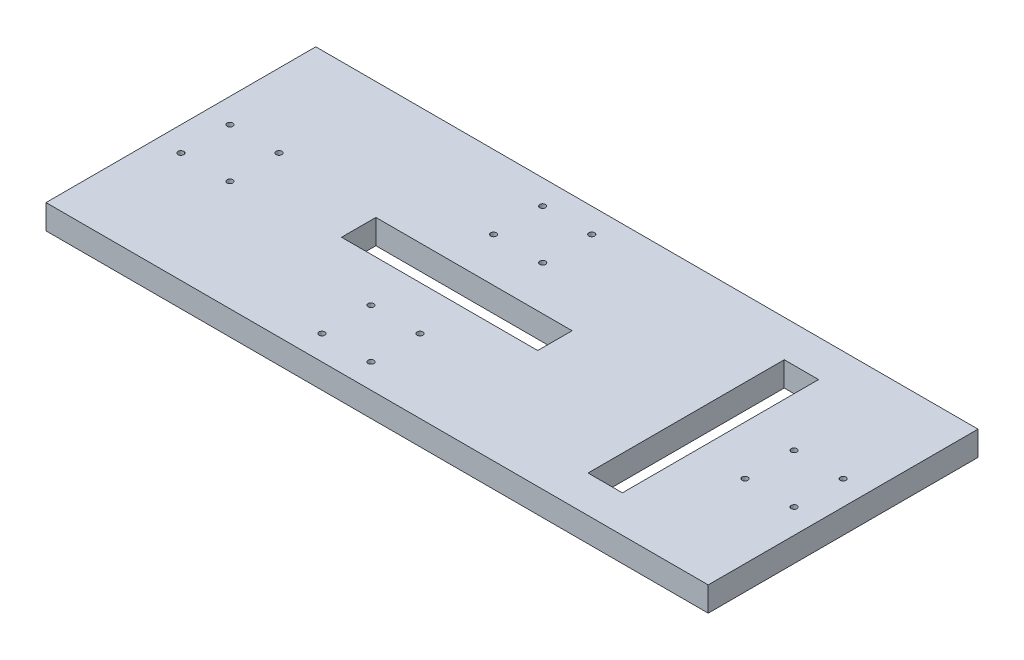
ISO-10303-21;
HEADER;
FILE_DESCRIPTION(('STEP AP214'),'2;1');
FILE_NAME('part.step','',(''),(''),'','','');
FILE_SCHEMA(('AUTOMOTIVE_DESIGN { 1 0 10303 214 1 1 1 1 }'));
ENDSEC;
DATA;
#1=APPLICATION_CONTEXT('core data for automotive mechanical design processes');
#2=APPLICATION_PROTOCOL_DEFINITION('international standard','automotive_design',2000,#1);
#3=PRODUCT_CONTEXT('',#1,'mechanical');
#4=PRODUCT('Part','Part','',(#3));
#5=PRODUCT_RELATED_PRODUCT_CATEGORY('part','',(#4));
#6=PRODUCT_DEFINITION_FORMATION('','',#4);
#7=PRODUCT_DEFINITION_CONTEXT('part definition',#1,'design');
#8=PRODUCT_DEFINITION('design','',#6,#7);
#9=PRODUCT_DEFINITION_SHAPE('','',#8);
#10=(LENGTH_UNIT() NAMED_UNIT(*) SI_UNIT(.MILLI.,.METRE.));
#11=(NAMED_UNIT(*) PLANE_ANGLE_UNIT() SI_UNIT($,.RADIAN.));
#12=(NAMED_UNIT(*) SI_UNIT($,.STERADIAN.) SOLID_ANGLE_UNIT());
#13=UNCERTAINTY_MEASURE_WITH_UNIT(LENGTH_MEASURE(1.E-05),#10,'distance_accuracy_value','');
#14=(GEOMETRIC_REPRESENTATION_CONTEXT(3) GLOBAL_UNCERTAINTY_ASSIGNED_CONTEXT((#13)) GLOBAL_UNIT_ASSIGNED_CONTEXT((#10,
#11,#12)) REPRESENTATION_CONTEXT('',''));
#15=CARTESIAN_POINT('',(0.,0.,0.));
#16=DIRECTION('',(0.,0.,1.));
#17=DIRECTION('',(1.,0.,0.));
#18=AXIS2_PLACEMENT_3D('',#15,#16,#17);
#19=CARTESIAN_POINT('',(0.,12.7,0.));
#20=DIRECTION('',(1.,0.,0.));
#21=DIRECTION('',(0.,0.,-1.));
#22=AXIS2_PLACEMENT_3D('',#19,#20,#21);
#23=PLANE('',#22);
#24=DIRECTION('',(0.,0.,1.));
#25=VECTOR('',#24,1.);
#26=CARTESIAN_POINT('',(0.,0.,0.));
#27=LINE('',#26,#25);
#28=CARTESIAN_POINT('',(0.,0.,-139.7));
#29=VERTEX_POINT('',#28);
#30=CARTESIAN_POINT('',(0.,0.,0.));
#31=VERTEX_POINT('',#30);
#32=EDGE_CURVE('E243',#29,#31,#27,.T.);
#33=ORIENTED_EDGE('',*,*,#32,.T.);
#34=DIRECTION('',(0.,-1.,0.));
#35=VECTOR('',#34,1.);
#36=CARTESIAN_POINT('',(0.,12.7,0.));
#37=LINE('',#36,#35);
#38=CARTESIAN_POINT('',(0.,12.7,0.));
#39=VERTEX_POINT('',#38);
#40=EDGE_CURVE('E11',#39,#31,#37,.T.);
#41=ORIENTED_EDGE('',*,*,#40,.F.);
#42=DIRECTION('',(0.,0.,1.));
#43=VECTOR('',#42,1.);
#44=CARTESIAN_POINT('',(0.,12.7,0.));
#45=LINE('',#44,#43);
#46=CARTESIAN_POINT('',(0.,12.7,-139.7));
#47=VERTEX_POINT('',#46);
#48=EDGE_CURVE('E246',#47,#39,#45,.T.);
#49=ORIENTED_EDGE('',*,*,#48,.F.);
#50=DIRECTION('',(0.,-1.,0.));
#51=VECTOR('',#50,1.);
#52=CARTESIAN_POINT('',(0.,12.7,-139.7));
#53=LINE('',#52,#51);
#54=EDGE_CURVE('E256',#47,#29,#53,.T.);
#55=ORIENTED_EDGE('',*,*,#54,.T.);
#56=EDGE_LOOP('',(#33,#41,#49,#55));
#57=FACE_BOUND('',#56,.T.);
#58=ADVANCED_FACE('F36',(#57),#23,.F.);
#59=CARTESIAN_POINT('',(0.,12.7,0.));
#60=DIRECTION('',(0.,0.,-1.));
#61=DIRECTION('',(-1.,0.,0.));
#62=AXIS2_PLACEMENT_3D('',#59,#60,#61);
#63=PLANE('',#62);
#64=DIRECTION('',(1.,0.,0.));
#65=VECTOR('',#64,1.);
#66=CARTESIAN_POINT('',(0.,0.,0.));
#67=LINE('',#66,#65);
#68=CARTESIAN_POINT('',(342.9,0.,0.));
#69=VERTEX_POINT('',#68);
#70=EDGE_CURVE('E259',#31,#69,#67,.T.);
#71=ORIENTED_EDGE('',*,*,#70,.T.);
#72=DIRECTION('',(0.,-1.,0.));
#73=VECTOR('',#72,1.);
#74=CARTESIAN_POINT('',(342.9,12.7,0.));
#75=LINE('',#74,#73);
#76=CARTESIAN_POINT('',(342.9,12.7,0.));
#77=VERTEX_POINT('',#76);
#78=EDGE_CURVE('E43',#77,#69,#75,.T.);
#79=ORIENTED_EDGE('',*,*,#78,.F.);
#80=DIRECTION('',(1.,0.,0.));
#81=VECTOR('',#80,1.);
#82=CARTESIAN_POINT('',(0.,12.7,0.));
#83=LINE('',#82,#81);
#84=EDGE_CURVE('E249',#39,#77,#83,.T.);
#85=ORIENTED_EDGE('',*,*,#84,.F.);
#86=ORIENTED_EDGE('',*,*,#40,.T.);
#87=EDGE_LOOP('',(#71,#79,#85,#86));
#88=FACE_BOUND('',#87,.T.);
#89=ADVANCED_FACE('F288',(#88),#63,.F.);
#90=CARTESIAN_POINT('',(342.9,12.7,0.));
#91=DIRECTION('',(-1.,0.,0.));
#92=DIRECTION('',(0.,0.,1.));
#93=AXIS2_PLACEMENT_3D('',#90,#91,#92);
#94=PLANE('',#93);
#95=DIRECTION('',(0.,0.,-1.));
#96=VECTOR('',#95,1.);
#97=CARTESIAN_POINT('',(342.9,0.,0.));
#98=LINE('',#97,#96);
#99=CARTESIAN_POINT('',(342.9,0.,-139.7));
#100=VERTEX_POINT('',#99);
#101=EDGE_CURVE('E261',#69,#100,#98,.T.);
#102=ORIENTED_EDGE('',*,*,#101,.T.);
#103=DIRECTION('',(0.,-1.,0.));
#104=VECTOR('',#103,1.);
#105=CARTESIAN_POINT('',(342.9,12.7,-139.7));
#106=LINE('',#105,#104);
#107=CARTESIAN_POINT('',(342.9,12.7,-139.7));
#108=VERTEX_POINT('',#107);
#109=EDGE_CURVE('E266',#108,#100,#106,.T.);
#110=ORIENTED_EDGE('',*,*,#109,.F.);
#111=DIRECTION('',(0.,0.,-1.));
#112=VECTOR('',#111,1.);
#113=CARTESIAN_POINT('',(342.9,12.7,0.));
#114=LINE('',#113,#112);
#115=EDGE_CURVE('E252',#77,#108,#114,.T.);
#116=ORIENTED_EDGE('',*,*,#115,.F.);
#117=ORIENTED_EDGE('',*,*,#78,.T.);
#118=EDGE_LOOP('',(#102,#110,#116,#117));
#119=FACE_BOUND('',#118,.T.);
#120=ADVANCED_FACE('F273',(#119),#94,.F.);
#121=CARTESIAN_POINT('',(0.,12.7,-139.7));
#122=DIRECTION('',(0.,0.,1.));
#123=DIRECTION('',(1.,0.,0.));
#124=AXIS2_PLACEMENT_3D('',#121,#122,#123);
#125=PLANE('',#124);
#126=DIRECTION('',(-1.,0.,0.));
#127=VECTOR('',#126,1.);
#128=CARTESIAN_POINT('',(0.,0.,-139.7));
#129=LINE('',#128,#127);
#130=EDGE_CURVE('E250',#100,#29,#129,.T.);
#131=ORIENTED_EDGE('',*,*,#130,.T.);
#132=ORIENTED_EDGE('',*,*,#54,.F.);
#133=DIRECTION('',(-1.,0.,0.));
#134=VECTOR('',#133,1.);
#135=CARTESIAN_POINT('',(0.,12.7,-139.7));
#136=LINE('',#135,#134);
#137=EDGE_CURVE('E254',#108,#47,#136,.T.);
#138=ORIENTED_EDGE('',*,*,#137,.F.);
#139=ORIENTED_EDGE('',*,*,#109,.T.);
#140=EDGE_LOOP('',(#131,#132,#138,#139));
#141=FACE_BOUND('',#140,.T.);
#142=ADVANCED_FACE('F281',(#141),#125,.F.);
#143=CARTESIAN_POINT('',(0.,12.7,0.));
#144=DIRECTION('',(0.,-1.,0.));
#145=DIRECTION('',(0.,0.,-1.));
#146=AXIS2_PLACEMENT_3D('',#143,#144,#145);
#147=PLANE('',#146);
#148=CARTESIAN_POINT('',(130.175,12.7,-38.1));
#149=DIRECTION('',(0.,-1.,0.));
#150=DIRECTION('',(0.,0.,-1.));
#151=AXIS2_PLACEMENT_3D('',#148,#149,#150);
#152=CIRCLE('',#151,1.5);
#153=CARTESIAN_POINT('',(130.175,12.7,-39.6));
#154=VERTEX_POINT('',#153);
#155=EDGE_CURVE('E417',#154,#154,#152,.T.);
#156=ORIENTED_EDGE('',*,*,#155,.T.);
#157=EDGE_LOOP('',(#156));
#158=FACE_BOUND('',#157,.T.);
#159=CARTESIAN_POINT('',(155.575,12.7,-38.1));
#160=DIRECTION('',(0.,-1.,0.));
#161=DIRECTION('',(0.,0.,-1.));
#162=AXIS2_PLACEMENT_3D('',#159,#160,#161);
#163=CIRCLE('',#162,1.5);
#164=CARTESIAN_POINT('',(155.575,12.7,-39.6));
#165=VERTEX_POINT('',#164);
#166=EDGE_CURVE('E409',#165,#165,#163,.T.);
#167=ORIENTED_EDGE('',*,*,#166,.T.);
#168=EDGE_LOOP('',(#167));
#169=FACE_BOUND('',#168,.T.);
#170=CARTESIAN_POINT('',(155.575,12.7,-12.7));
#171=DIRECTION('',(0.,-1.,0.));
#172=DIRECTION('',(0.,0.,-1.));
#173=AXIS2_PLACEMENT_3D('',#170,#171,#172);
#174=CIRCLE('',#173,1.5);
#175=CARTESIAN_POINT('',(155.575,12.7,-14.2));
#176=VERTEX_POINT('',#175);
#177=EDGE_CURVE('E402',#176,#176,#174,.T.);
#178=ORIENTED_EDGE('',*,*,#177,.T.);
#179=EDGE_LOOP('',(#178));
#180=FACE_BOUND('',#179,.T.);
#181=CARTESIAN_POINT('',(130.175,12.7,-12.7));
#182=DIRECTION('',(0.,-1.,0.));
#183=DIRECTION('',(0.,0.,-1.));
#184=AXIS2_PLACEMENT_3D('',#181,#182,#183);
#185=CIRCLE('',#184,1.5);
#186=CARTESIAN_POINT('',(130.175,12.7,-14.2));
#187=VERTEX_POINT('',#186);
#188=EDGE_CURVE('E406',#187,#187,#185,.T.);
#189=ORIENTED_EDGE('',*,*,#188,.T.);
#190=EDGE_LOOP('',(#189));
#191=FACE_BOUND('',#190,.T.);
#192=CARTESIAN_POINT('',(130.175,12.7,-101.6));
#193=DIRECTION('',(0.,1.,0.));
#194=DIRECTION('',(0.,0.,1.));
#195=AXIS2_PLACEMENT_3D('',#192,#193,#194);
#196=CIRCLE('',#195,1.5);
#197=CARTESIAN_POINT('',(130.175,12.7,-100.1));
#198=VERTEX_POINT('',#197);
#199=EDGE_CURVE('E423',#198,#198,#196,.T.);
#200=ORIENTED_EDGE('',*,*,#199,.F.);
#201=EDGE_LOOP('',(#200));
#202=FACE_BOUND('',#201,.T.);
#203=CARTESIAN_POINT('',(155.575,12.7,-101.6));
#204=DIRECTION('',(0.,1.,0.));
#205=DIRECTION('',(0.,0.,1.));
#206=AXIS2_PLACEMENT_3D('',#203,#204,#205);
#207=CIRCLE('',#206,1.5);
#208=CARTESIAN_POINT('',(155.575,12.7,-100.1));
#209=VERTEX_POINT('',#208);
#210=EDGE_CURVE('E435',#209,#209,#207,.T.);
#211=ORIENTED_EDGE('',*,*,#210,.F.);
#212=EDGE_LOOP('',(#211));
#213=FACE_BOUND('',#212,.T.);
#214=CARTESIAN_POINT('',(155.575,12.7,-127.));
#215=DIRECTION('',(0.,1.,0.));
#216=DIRECTION('',(0.,0.,1.));
#217=AXIS2_PLACEMENT_3D('',#214,#215,#216);
#218=CIRCLE('',#217,1.5);
#219=CARTESIAN_POINT('',(155.575,12.7,-125.5));
#220=VERTEX_POINT('',#219);
#221=EDGE_CURVE('E429',#220,#220,#218,.T.);
#222=ORIENTED_EDGE('',*,*,#221,.F.);
#223=EDGE_LOOP('',(#222));
#224=FACE_BOUND('',#223,.T.);
#225=CARTESIAN_POINT('',(130.175,12.7,-127.));
#226=DIRECTION('',(0.,1.,0.));
#227=DIRECTION('',(0.,0.,1.));
#228=AXIS2_PLACEMENT_3D('',#225,#226,#227);
#229=CIRCLE('',#228,1.5);
#230=CARTESIAN_POINT('',(130.175,12.7,-125.5));
#231=VERTEX_POINT('',#230);
#232=EDGE_CURVE('E151',#231,#231,#229,.T.);
#233=ORIENTED_EDGE('',*,*,#232,.F.);
#234=EDGE_LOOP('',(#233));
#235=FACE_BOUND('',#234,.T.);
#236=DIRECTION('',(1.,0.,0.));
#237=VECTOR('',#236,1.);
#238=CARTESIAN_POINT('',(261.62,12.7,-19.05));
#239=LINE('',#238,#237);
#240=CARTESIAN_POINT('',(261.62,12.7,-19.05));
#241=VERTEX_POINT('',#240);
#242=CARTESIAN_POINT('',(279.4,12.7,-19.05));
#243=VERTEX_POINT('',#242);
#244=EDGE_CURVE('E157',#241,#243,#239,.T.);
#245=ORIENTED_EDGE('',*,*,#244,.F.);
#246=DIRECTION('',(0.,0.,1.));
#247=VECTOR('',#246,1.);
#248=CARTESIAN_POINT('',(261.62,12.7,-120.65));
#249=LINE('',#248,#247);
#250=CARTESIAN_POINT('',(261.62,12.7,-120.65));
#251=VERTEX_POINT('',#250);
#252=EDGE_CURVE('E50',#251,#241,#249,.T.);
#253=ORIENTED_EDGE('',*,*,#252,.F.);
#254=DIRECTION('',(-1.,0.,0.));
#255=VECTOR('',#254,1.);
#256=CARTESIAN_POINT('',(261.62,12.7,-120.65));
#257=LINE('',#256,#255);
#258=CARTESIAN_POINT('',(279.4,12.7,-120.65));
#259=VERTEX_POINT('',#258);
#260=EDGE_CURVE('E145',#259,#251,#257,.T.);
#261=ORIENTED_EDGE('',*,*,#260,.F.);
#262=DIRECTION('',(0.,0.,-1.));
#263=VECTOR('',#262,1.);
#264=CARTESIAN_POINT('',(279.4,12.7,-120.65));
#265=LINE('',#264,#263);
#266=EDGE_CURVE('E148',#243,#259,#265,.T.);
#267=ORIENTED_EDGE('',*,*,#266,.F.);
#268=EDGE_LOOP('',(#245,#253,#261,#267));
#269=FACE_BOUND('',#268,.T.);
#270=DIRECTION('',(1.,0.,0.));
#271=VECTOR('',#270,1.);
#272=CARTESIAN_POINT('',(92.075,12.7,-60.96));
#273=LINE('',#272,#271);
#274=CARTESIAN_POINT('',(92.075,12.7,-60.96));
#275=VERTEX_POINT('',#274);
#276=CARTESIAN_POINT('',(193.675,12.7,-60.96));
#277=VERTEX_POINT('',#276);
#278=EDGE_CURVE('E183',#275,#277,#273,.T.);
#279=ORIENTED_EDGE('',*,*,#278,.F.);
#280=DIRECTION('',(0.,0.,1.));
#281=VECTOR('',#280,1.);
#282=CARTESIAN_POINT('',(92.075,12.7,-78.74));
#283=LINE('',#282,#281);
#284=CARTESIAN_POINT('',(92.075,12.7,-78.74));
#285=VERTEX_POINT('',#284);
#286=EDGE_CURVE('E58',#285,#275,#283,.T.);
#287=ORIENTED_EDGE('',*,*,#286,.F.);
#288=DIRECTION('',(-1.,0.,0.));
#289=VECTOR('',#288,1.);
#290=CARTESIAN_POINT('',(92.075,12.7,-78.74));
#291=LINE('',#290,#289);
#292=CARTESIAN_POINT('',(193.675,12.7,-78.74));
#293=VERTEX_POINT('',#292);
#294=EDGE_CURVE('E172',#293,#285,#291,.T.);
#295=ORIENTED_EDGE('',*,*,#294,.F.);
#296=DIRECTION('',(0.,0.,-1.));
#297=VECTOR('',#296,1.);
#298=CARTESIAN_POINT('',(193.675,12.7,-78.74));
#299=LINE('',#298,#297);
#300=EDGE_CURVE('E187',#277,#293,#299,.T.);
#301=ORIENTED_EDGE('',*,*,#300,.F.);
#302=EDGE_LOOP('',(#279,#287,#295,#301));
#303=FACE_BOUND('',#302,.T.);
#304=CARTESIAN_POINT('',(38.1,12.7,-82.55));
#305=DIRECTION('',(0.,-1.,0.));
#306=DIRECTION('',(0.,0.,1.));
#307=AXIS2_PLACEMENT_3D('',#304,#305,#306);
#308=CIRCLE('',#307,1.50000004800013);
#309=CARTESIAN_POINT('',(38.1,12.7,-81.0499999519999));
#310=VERTEX_POINT('',#309);
#311=EDGE_CURVE('E164',#310,#310,#308,.T.);
#312=ORIENTED_EDGE('',*,*,#311,.T.);
#313=EDGE_LOOP('',(#312));
#314=FACE_BOUND('',#313,.T.);
#315=CARTESIAN_POINT('',(38.1,12.7,-57.15));
#316=DIRECTION('',(0.,-1.,0.));
#317=DIRECTION('',(0.,0.,1.));
#318=AXIS2_PLACEMENT_3D('',#315,#316,#317);
#319=CIRCLE('',#318,1.50000000000002);
#320=CARTESIAN_POINT('',(38.1,12.7,-55.65));
#321=VERTEX_POINT('',#320);
#322=EDGE_CURVE('E208',#321,#321,#319,.T.);
#323=ORIENTED_EDGE('',*,*,#322,.T.);
#324=EDGE_LOOP('',(#323));
#325=FACE_BOUND('',#324,.T.);
#326=CARTESIAN_POINT('',(12.7,12.7,-57.15));
#327=DIRECTION('',(0.,-1.,0.));
#328=DIRECTION('',(0.,0.,1.));
#329=AXIS2_PLACEMENT_3D('',#326,#327,#328);
#330=CIRCLE('',#329,1.50000004800013);
#331=CARTESIAN_POINT('',(12.7,12.7,-55.6499999519999));
#332=VERTEX_POINT('',#331);
#333=EDGE_CURVE('E202',#332,#332,#330,.T.);
#334=ORIENTED_EDGE('',*,*,#333,.T.);
#335=EDGE_LOOP('',(#334));
#336=FACE_BOUND('',#335,.T.);
#337=CARTESIAN_POINT('',(12.7,12.7,-82.55));
#338=DIRECTION('',(0.,-1.,0.));
#339=DIRECTION('',(0.,0.,1.));
#340=AXIS2_PLACEMENT_3D('',#337,#338,#339);
#341=CIRCLE('',#340,1.50000000000002);
#342=CARTESIAN_POINT('',(12.7,12.7,-81.05));
#343=VERTEX_POINT('',#342);
#344=EDGE_CURVE('E201',#343,#343,#341,.T.);
#345=ORIENTED_EDGE('',*,*,#344,.T.);
#346=EDGE_LOOP('',(#345));
#347=FACE_BOUND('',#346,.T.);
#348=CARTESIAN_POINT('',(304.8,12.7,-82.55));
#349=DIRECTION('',(0.,1.,0.));
#350=DIRECTION('',(0.,0.,1.));
#351=AXIS2_PLACEMENT_3D('',#348,#349,#350);
#352=CIRCLE('',#351,1.50000004800013);
#353=CARTESIAN_POINT('',(304.8,12.7,-81.0499999519999));
#354=VERTEX_POINT('',#353);
#355=EDGE_CURVE('E219',#354,#354,#352,.T.);
#356=ORIENTED_EDGE('',*,*,#355,.F.);
#357=EDGE_LOOP('',(#356));
#358=FACE_BOUND('',#357,.T.);
#359=CARTESIAN_POINT('',(304.8,12.7,-57.15));
#360=DIRECTION('',(0.,1.,0.));
#361=DIRECTION('',(0.,0.,1.));
#362=AXIS2_PLACEMENT_3D('',#359,#360,#361);
#363=CIRCLE('',#362,1.50000000000002);
#364=CARTESIAN_POINT('',(304.8,12.7,-55.65));
#365=VERTEX_POINT('',#364);
#366=EDGE_CURVE('E232',#365,#365,#363,.T.);
#367=ORIENTED_EDGE('',*,*,#366,.F.);
#368=EDGE_LOOP('',(#367));
#369=FACE_BOUND('',#368,.T.);
#370=CARTESIAN_POINT('',(330.2,12.7,-57.15));
#371=DIRECTION('',(0.,1.,0.));
#372=DIRECTION('',(0.,0.,1.));
#373=AXIS2_PLACEMENT_3D('',#370,#371,#372);
#374=CIRCLE('',#373,1.50000004800013);
#375=CARTESIAN_POINT('',(330.2,12.7,-55.6499999519999));
#376=VERTEX_POINT('',#375);
#377=EDGE_CURVE('E226',#376,#376,#374,.T.);
#378=ORIENTED_EDGE('',*,*,#377,.F.);
#379=EDGE_LOOP('',(#378));
#380=FACE_BOUND('',#379,.T.);
#381=CARTESIAN_POINT('',(330.2,12.7,-82.55));
#382=DIRECTION('',(0.,1.,0.));
#383=DIRECTION('',(0.,0.,1.));
#384=AXIS2_PLACEMENT_3D('',#381,#382,#383);
#385=CIRCLE('',#384,1.50000000000002);
#386=CARTESIAN_POINT('',(330.2,12.7,-81.05));
#387=VERTEX_POINT('',#386);
#388=EDGE_CURVE('E225',#387,#387,#385,.T.);
#389=ORIENTED_EDGE('',*,*,#388,.F.);
#390=EDGE_LOOP('',(#389));
#391=FACE_BOUND('',#390,.T.);
#392=ORIENTED_EDGE('',*,*,#48,.T.);
#393=ORIENTED_EDGE('',*,*,#84,.T.);
#394=ORIENTED_EDGE('',*,*,#115,.T.);
#395=ORIENTED_EDGE('',*,*,#137,.T.);
#396=EDGE_LOOP('',(#392,#393,#394,#395));
#397=FACE_BOUND('',#396,.T.);
#398=ADVANCED_FACE('F287',(#158,#169,#180,#191,#202,#213,#224,#235,#269,#303,#314,#325,#336,
#347,#358,#369,#380,#391,#397),#147,.F.);
#399=CARTESIAN_POINT('',(0.,0.,0.));
#400=DIRECTION('',(0.,-1.,0.));
#401=DIRECTION('',(0.,0.,-1.));
#402=AXIS2_PLACEMENT_3D('',#399,#400,#401);
#403=PLANE('',#402);
#404=CARTESIAN_POINT('',(130.175,0.,-38.1));
#405=DIRECTION('',(0.,-1.,0.));
#406=DIRECTION('',(0.,0.,-1.));
#407=AXIS2_PLACEMENT_3D('',#404,#405,#406);
#408=CIRCLE('',#407,1.5);
#409=CARTESIAN_POINT('',(130.175,0.,-39.6));
#410=VERTEX_POINT('',#409);
#411=EDGE_CURVE('E414',#410,#410,#408,.T.);
#412=ORIENTED_EDGE('',*,*,#411,.F.);
#413=EDGE_LOOP('',(#412));
#414=FACE_BOUND('',#413,.T.);
#415=CARTESIAN_POINT('',(155.575,0.,-38.1));
#416=DIRECTION('',(0.,-1.,0.));
#417=DIRECTION('',(0.,0.,-1.));
#418=AXIS2_PLACEMENT_3D('',#415,#416,#417);
#419=CIRCLE('',#418,1.5);
#420=CARTESIAN_POINT('',(155.575,0.,-39.6));
#421=VERTEX_POINT('',#420);
#422=EDGE_CURVE('E404',#421,#421,#419,.T.);
#423=ORIENTED_EDGE('',*,*,#422,.F.);
#424=EDGE_LOOP('',(#423));
#425=FACE_BOUND('',#424,.T.);
#426=CARTESIAN_POINT('',(155.575,0.,-12.7));
#427=DIRECTION('',(0.,-1.,0.));
#428=DIRECTION('',(0.,0.,-1.));
#429=AXIS2_PLACEMENT_3D('',#426,#427,#428);
#430=CIRCLE('',#429,1.5);
#431=CARTESIAN_POINT('',(155.575,0.,-14.2));
#432=VERTEX_POINT('',#431);
#433=EDGE_CURVE('E399',#432,#432,#430,.T.);
#434=ORIENTED_EDGE('',*,*,#433,.F.);
#435=EDGE_LOOP('',(#434));
#436=FACE_BOUND('',#435,.T.);
#437=CARTESIAN_POINT('',(130.175,0.,-12.7));
#438=DIRECTION('',(0.,-1.,0.));
#439=DIRECTION('',(0.,0.,-1.));
#440=AXIS2_PLACEMENT_3D('',#437,#438,#439);
#441=CIRCLE('',#440,1.5);
#442=CARTESIAN_POINT('',(130.175,0.,-14.2));
#443=VERTEX_POINT('',#442);
#444=EDGE_CURVE('E420',#443,#443,#441,.T.);
#445=ORIENTED_EDGE('',*,*,#444,.F.);
#446=EDGE_LOOP('',(#445));
#447=FACE_BOUND('',#446,.T.);
#448=CARTESIAN_POINT('',(130.175,0.,-101.6));
#449=DIRECTION('',(0.,1.,0.));
#450=DIRECTION('',(0.,0.,1.));
#451=AXIS2_PLACEMENT_3D('',#448,#449,#450);
#452=CIRCLE('',#451,1.5);
#453=CARTESIAN_POINT('',(130.175,0.,-100.1));
#454=VERTEX_POINT('',#453);
#455=EDGE_CURVE('E438',#454,#454,#452,.T.);
#456=ORIENTED_EDGE('',*,*,#455,.T.);
#457=EDGE_LOOP('',(#456));
#458=FACE_BOUND('',#457,.T.);
#459=CARTESIAN_POINT('',(155.575,0.,-101.6));
#460=DIRECTION('',(0.,1.,0.));
#461=DIRECTION('',(0.,0.,1.));
#462=AXIS2_PLACEMENT_3D('',#459,#460,#461);
#463=CIRCLE('',#462,1.5);
#464=CARTESIAN_POINT('',(155.575,0.,-100.1));
#465=VERTEX_POINT('',#464);
#466=EDGE_CURVE('E432',#465,#465,#463,.T.);
#467=ORIENTED_EDGE('',*,*,#466,.T.);
#468=EDGE_LOOP('',(#467));
#469=FACE_BOUND('',#468,.T.);
#470=CARTESIAN_POINT('',(155.575,0.,-127.));
#471=DIRECTION('',(0.,1.,0.));
#472=DIRECTION('',(0.,0.,1.));
#473=AXIS2_PLACEMENT_3D('',#470,#471,#472);
#474=CIRCLE('',#473,1.5);
#475=CARTESIAN_POINT('',(155.575,0.,-125.5));
#476=VERTEX_POINT('',#475);
#477=EDGE_CURVE('E426',#476,#476,#474,.T.);
#478=ORIENTED_EDGE('',*,*,#477,.T.);
#479=EDGE_LOOP('',(#478));
#480=FACE_BOUND('',#479,.T.);
#481=CARTESIAN_POINT('',(130.175,0.,-127.));
#482=DIRECTION('',(0.,1.,0.));
#483=DIRECTION('',(0.,0.,1.));
#484=AXIS2_PLACEMENT_3D('',#481,#482,#483);
#485=CIRCLE('',#484,1.5);
#486=CARTESIAN_POINT('',(130.175,0.,-125.5));
#487=VERTEX_POINT('',#486);
#488=EDGE_CURVE('E184',#487,#487,#485,.T.);
#489=ORIENTED_EDGE('',*,*,#488,.T.);
#490=EDGE_LOOP('',(#489));
#491=FACE_BOUND('',#490,.T.);
#492=DIRECTION('',(0.,0.,1.));
#493=VECTOR('',#492,1.);
#494=CARTESIAN_POINT('',(261.62,0.,-120.65));
#495=LINE('',#494,#493);
#496=CARTESIAN_POINT('',(261.62,0.,-120.65));
#497=VERTEX_POINT('',#496);
#498=CARTESIAN_POINT('',(261.62,0.,-19.05));
#499=VERTEX_POINT('',#498);
#500=EDGE_CURVE('E126',#497,#499,#495,.T.);
#501=ORIENTED_EDGE('',*,*,#500,.T.);
#502=DIRECTION('',(1.,0.,0.));
#503=VECTOR('',#502,1.);
#504=CARTESIAN_POINT('',(261.62,0.,-19.05));
#505=LINE('',#504,#503);
#506=CARTESIAN_POINT('',(279.4,0.,-19.05));
#507=VERTEX_POINT('',#506);
#508=EDGE_CURVE('E136',#499,#507,#505,.T.);
#509=ORIENTED_EDGE('',*,*,#508,.T.);
#510=DIRECTION('',(0.,0.,-1.));
#511=VECTOR('',#510,1.);
#512=CARTESIAN_POINT('',(279.4,0.,-120.65));
#513=LINE('',#512,#511);
#514=CARTESIAN_POINT('',(279.4,0.,-120.65));
#515=VERTEX_POINT('',#514);
#516=EDGE_CURVE('E140',#507,#515,#513,.T.);
#517=ORIENTED_EDGE('',*,*,#516,.T.);
#518=DIRECTION('',(-1.,0.,0.));
#519=VECTOR('',#518,1.);
#520=CARTESIAN_POINT('',(261.62,0.,-120.65));
#521=LINE('',#520,#519);
#522=EDGE_CURVE('E132',#515,#497,#521,.T.);
#523=ORIENTED_EDGE('',*,*,#522,.T.);
#524=EDGE_LOOP('',(#501,#509,#517,#523));
#525=FACE_BOUND('',#524,.T.);
#526=DIRECTION('',(0.,0.,1.));
#527=VECTOR('',#526,1.);
#528=CARTESIAN_POINT('',(92.075,0.,-78.74));
#529=LINE('',#528,#527);
#530=CARTESIAN_POINT('',(92.075,0.,-78.74));
#531=VERTEX_POINT('',#530);
#532=CARTESIAN_POINT('',(92.075,0.,-60.96));
#533=VERTEX_POINT('',#532);
#534=EDGE_CURVE('E168',#531,#533,#529,.T.);
#535=ORIENTED_EDGE('',*,*,#534,.T.);
#536=DIRECTION('',(1.,0.,0.));
#537=VECTOR('',#536,1.);
#538=CARTESIAN_POINT('',(92.075,0.,-60.96));
#539=LINE('',#538,#537);
#540=CARTESIAN_POINT('',(193.675,0.,-60.96));
#541=VERTEX_POINT('',#540);
#542=EDGE_CURVE('E171',#533,#541,#539,.T.);
#543=ORIENTED_EDGE('',*,*,#542,.T.);
#544=DIRECTION('',(0.,0.,-1.));
#545=VECTOR('',#544,1.);
#546=CARTESIAN_POINT('',(193.675,0.,-78.74));
#547=LINE('',#546,#545);
#548=CARTESIAN_POINT('',(193.675,0.,-78.74));
#549=VERTEX_POINT('',#548);
#550=EDGE_CURVE('E175',#541,#549,#547,.T.);
#551=ORIENTED_EDGE('',*,*,#550,.T.);
#552=DIRECTION('',(-1.,0.,0.));
#553=VECTOR('',#552,1.);
#554=CARTESIAN_POINT('',(92.075,0.,-78.74));
#555=LINE('',#554,#553);
#556=EDGE_CURVE('E178',#549,#531,#555,.T.);
#557=ORIENTED_EDGE('',*,*,#556,.T.);
#558=EDGE_LOOP('',(#535,#543,#551,#557));
#559=FACE_BOUND('',#558,.T.);
#560=CARTESIAN_POINT('',(38.1,0.,-82.55));
#561=DIRECTION('',(0.,-1.,0.));
#562=DIRECTION('',(0.,0.,1.));
#563=AXIS2_PLACEMENT_3D('',#560,#561,#562);
#564=CIRCLE('',#563,1.50000004800013);
#565=CARTESIAN_POINT('',(38.1,0.,-81.0499999519999));
#566=VERTEX_POINT('',#565);
#567=EDGE_CURVE('E211',#566,#566,#564,.T.);
#568=ORIENTED_EDGE('',*,*,#567,.F.);
#569=EDGE_LOOP('',(#568));
#570=FACE_BOUND('',#569,.T.);
#571=CARTESIAN_POINT('',(38.1,0.,-57.15));
#572=DIRECTION('',(0.,-1.,0.));
#573=DIRECTION('',(0.,0.,1.));
#574=AXIS2_PLACEMENT_3D('',#571,#572,#573);
#575=CIRCLE('',#574,1.50000000000002);
#576=CARTESIAN_POINT('',(38.1,0.,-55.65));
#577=VERTEX_POINT('',#576);
#578=EDGE_CURVE('E205',#577,#577,#575,.T.);
#579=ORIENTED_EDGE('',*,*,#578,.F.);
#580=EDGE_LOOP('',(#579));
#581=FACE_BOUND('',#580,.T.);
#582=CARTESIAN_POINT('',(12.7,0.,-57.15));
#583=DIRECTION('',(0.,-1.,0.));
#584=DIRECTION('',(0.,0.,1.));
#585=AXIS2_PLACEMENT_3D('',#582,#583,#584);
#586=CIRCLE('',#585,1.50000004800013);
#587=CARTESIAN_POINT('',(12.7,0.,-55.6499999519999));
#588=VERTEX_POINT('',#587);
#589=EDGE_CURVE('E198',#588,#588,#586,.T.);
#590=ORIENTED_EDGE('',*,*,#589,.F.);
#591=EDGE_LOOP('',(#590));
#592=FACE_BOUND('',#591,.T.);
#593=CARTESIAN_POINT('',(12.7,0.,-82.55));
#594=DIRECTION('',(0.,-1.,0.));
#595=DIRECTION('',(0.,0.,1.));
#596=AXIS2_PLACEMENT_3D('',#593,#594,#595);
#597=CIRCLE('',#596,1.50000000000002);
#598=CARTESIAN_POINT('',(12.7,0.,-81.05));
#599=VERTEX_POINT('',#598);
#600=EDGE_CURVE('E216',#599,#599,#597,.T.);
#601=ORIENTED_EDGE('',*,*,#600,.F.);
#602=EDGE_LOOP('',(#601));
#603=FACE_BOUND('',#602,.T.);
#604=CARTESIAN_POINT('',(304.8,0.,-82.55));
#605=DIRECTION('',(0.,1.,0.));
#606=DIRECTION('',(0.,0.,1.));
#607=AXIS2_PLACEMENT_3D('',#604,#605,#606);
#608=CIRCLE('',#607,1.50000004800013);
#609=CARTESIAN_POINT('',(304.8,0.,-81.0499999519999));
#610=VERTEX_POINT('',#609);
#611=EDGE_CURVE('E235',#610,#610,#608,.T.);
#612=ORIENTED_EDGE('',*,*,#611,.T.);
#613=EDGE_LOOP('',(#612));
#614=FACE_BOUND('',#613,.T.);
#615=CARTESIAN_POINT('',(304.8,0.,-57.15));
#616=DIRECTION('',(0.,1.,0.));
#617=DIRECTION('',(0.,0.,1.));
#618=AXIS2_PLACEMENT_3D('',#615,#616,#617);
#619=CIRCLE('',#618,1.50000000000002);
#620=CARTESIAN_POINT('',(304.8,0.,-55.65));
#621=VERTEX_POINT('',#620);
#622=EDGE_CURVE('E229',#621,#621,#619,.T.);
#623=ORIENTED_EDGE('',*,*,#622,.T.);
#624=EDGE_LOOP('',(#623));
#625=FACE_BOUND('',#624,.T.);
#626=CARTESIAN_POINT('',(330.2,0.,-57.15));
#627=DIRECTION('',(0.,1.,0.));
#628=DIRECTION('',(0.,0.,1.));
#629=AXIS2_PLACEMENT_3D('',#626,#627,#628);
#630=CIRCLE('',#629,1.50000004800013);
#631=CARTESIAN_POINT('',(330.2,0.,-55.6499999519999));
#632=VERTEX_POINT('',#631);
#633=EDGE_CURVE('E222',#632,#632,#630,.T.);
#634=ORIENTED_EDGE('',*,*,#633,.T.);
#635=EDGE_LOOP('',(#634));
#636=FACE_BOUND('',#635,.T.);
#637=CARTESIAN_POINT('',(330.2,0.,-82.55));
#638=DIRECTION('',(0.,1.,0.));
#639=DIRECTION('',(0.,0.,1.));
#640=AXIS2_PLACEMENT_3D('',#637,#638,#639);
#641=CIRCLE('',#640,1.50000000000002);
#642=CARTESIAN_POINT('',(330.2,0.,-81.05));
#643=VERTEX_POINT('',#642);
#644=EDGE_CURVE('E240',#643,#643,#641,.T.);
#645=ORIENTED_EDGE('',*,*,#644,.T.);
#646=EDGE_LOOP('',(#645));
#647=FACE_BOUND('',#646,.T.);
#648=ORIENTED_EDGE('',*,*,#32,.F.);
#649=ORIENTED_EDGE('',*,*,#130,.F.);
#650=ORIENTED_EDGE('',*,*,#101,.F.);
#651=ORIENTED_EDGE('',*,*,#70,.F.);
#652=EDGE_LOOP('',(#648,#649,#650,#651));
#653=FACE_BOUND('',#652,.T.);
#654=ADVANCED_FACE('F142',(#414,#425,#436,#447,#458,#469,#480,#491,#525,#559,#570,#581,#592,
#603,#614,#625,#636,#647,#653),#403,.T.);
#655=CARTESIAN_POINT('',(330.2,0.,-82.55));
#656=DIRECTION('',(0.,1.,0.));
#657=DIRECTION('',(0.,0.,1.));
#658=AXIS2_PLACEMENT_3D('',#655,#656,#657);
#659=CYLINDRICAL_SURFACE('',#658,1.50000000000002);
#660=ORIENTED_EDGE('',*,*,#644,.F.);
#661=EDGE_LOOP('',(#660));
#662=FACE_BOUND('',#661,.T.);
#663=ORIENTED_EDGE('',*,*,#388,.T.);
#664=EDGE_LOOP('',(#663));
#665=FACE_BOUND('',#664,.T.);
#666=ADVANCED_FACE('F300',(#662,#665),#659,.F.);
#667=CARTESIAN_POINT('',(330.2,0.,-57.15));
#668=DIRECTION('',(0.,1.,0.));
#669=DIRECTION('',(0.,0.,1.));
#670=AXIS2_PLACEMENT_3D('',#667,#668,#669);
#671=CYLINDRICAL_SURFACE('',#670,1.50000004800013);
#672=ORIENTED_EDGE('',*,*,#633,.F.);
#673=EDGE_LOOP('',(#672));
#674=FACE_BOUND('',#673,.T.);
#675=ORIENTED_EDGE('',*,*,#377,.T.);
#676=EDGE_LOOP('',(#675));
#677=FACE_BOUND('',#676,.T.);
#678=ADVANCED_FACE('F307',(#674,#677),#671,.F.);
#679=CARTESIAN_POINT('',(304.8,0.,-57.15));
#680=DIRECTION('',(0.,1.,0.));
#681=DIRECTION('',(0.,0.,1.));
#682=AXIS2_PLACEMENT_3D('',#679,#680,#681);
#683=CYLINDRICAL_SURFACE('',#682,1.50000000000002);
#684=ORIENTED_EDGE('',*,*,#622,.F.);
#685=EDGE_LOOP('',(#684));
#686=FACE_BOUND('',#685,.T.);
#687=ORIENTED_EDGE('',*,*,#366,.T.);
#688=EDGE_LOOP('',(#687));
#689=FACE_BOUND('',#688,.T.);
#690=ADVANCED_FACE('F313',(#686,#689),#683,.F.);
#691=CARTESIAN_POINT('',(304.8,0.,-82.55));
#692=DIRECTION('',(0.,1.,0.));
#693=DIRECTION('',(0.,0.,1.));
#694=AXIS2_PLACEMENT_3D('',#691,#692,#693);
#695=CYLINDRICAL_SURFACE('',#694,1.50000004800013);
#696=ORIENTED_EDGE('',*,*,#611,.F.);
#697=EDGE_LOOP('',(#696));
#698=FACE_BOUND('',#697,.T.);
#699=ORIENTED_EDGE('',*,*,#355,.T.);
#700=EDGE_LOOP('',(#699));
#701=FACE_BOUND('',#700,.T.);
#702=ADVANCED_FACE('F309',(#698,#701),#695,.F.);
#703=CARTESIAN_POINT('',(12.7,0.,-82.55));
#704=DIRECTION('',(0.,1.,0.));
#705=DIRECTION('',(0.,0.,1.));
#706=AXIS2_PLACEMENT_3D('',#703,#704,#705);
#707=CYLINDRICAL_SURFACE('',#706,1.50000000000002);
#708=ORIENTED_EDGE('',*,*,#600,.T.);
#709=EDGE_LOOP('',(#708));
#710=FACE_BOUND('',#709,.T.);
#711=ORIENTED_EDGE('',*,*,#344,.F.);
#712=EDGE_LOOP('',(#711));
#713=FACE_BOUND('',#712,.T.);
#714=ADVANCED_FACE('F312',(#710,#713),#707,.F.);
#715=CARTESIAN_POINT('',(12.7,0.,-57.15));
#716=DIRECTION('',(0.,1.,0.));
#717=DIRECTION('',(0.,0.,1.));
#718=AXIS2_PLACEMENT_3D('',#715,#716,#717);
#719=CYLINDRICAL_SURFACE('',#718,1.50000004800013);
#720=ORIENTED_EDGE('',*,*,#589,.T.);
#721=EDGE_LOOP('',(#720));
#722=FACE_BOUND('',#721,.T.);
#723=ORIENTED_EDGE('',*,*,#333,.F.);
#724=EDGE_LOOP('',(#723));
#725=FACE_BOUND('',#724,.T.);
#726=ADVANCED_FACE('F323',(#722,#725),#719,.F.);
#727=CARTESIAN_POINT('',(38.1,0.,-57.15));
#728=DIRECTION('',(0.,1.,0.));
#729=DIRECTION('',(0.,0.,1.));
#730=AXIS2_PLACEMENT_3D('',#727,#728,#729);
#731=CYLINDRICAL_SURFACE('',#730,1.50000000000002);
#732=ORIENTED_EDGE('',*,*,#578,.T.);
#733=EDGE_LOOP('',(#732));
#734=FACE_BOUND('',#733,.T.);
#735=ORIENTED_EDGE('',*,*,#322,.F.);
#736=EDGE_LOOP('',(#735));
#737=FACE_BOUND('',#736,.T.);
#738=ADVANCED_FACE('F329',(#734,#737),#731,.F.);
#739=CARTESIAN_POINT('',(38.1,0.,-82.55));
#740=DIRECTION('',(0.,1.,0.));
#741=DIRECTION('',(0.,0.,1.));
#742=AXIS2_PLACEMENT_3D('',#739,#740,#741);
#743=CYLINDRICAL_SURFACE('',#742,1.50000004800013);
#744=ORIENTED_EDGE('',*,*,#567,.T.);
#745=EDGE_LOOP('',(#744));
#746=FACE_BOUND('',#745,.T.);
#747=ORIENTED_EDGE('',*,*,#311,.F.);
#748=EDGE_LOOP('',(#747));
#749=FACE_BOUND('',#748,.T.);
#750=ADVANCED_FACE('F325',(#746,#749),#743,.F.);
#751=CARTESIAN_POINT('',(92.075,0.,-78.74));
#752=DIRECTION('',(-1.,0.,0.));
#753=DIRECTION('',(0.,0.,1.));
#754=AXIS2_PLACEMENT_3D('',#751,#752,#753);
#755=PLANE('',#754);
#756=ORIENTED_EDGE('',*,*,#286,.T.);
#757=DIRECTION('',(0.,1.,0.));
#758=VECTOR('',#757,1.);
#759=CARTESIAN_POINT('',(92.075,0.,-60.96));
#760=LINE('',#759,#758);
#761=EDGE_CURVE('E181',#533,#275,#760,.T.);
#762=ORIENTED_EDGE('',*,*,#761,.F.);
#763=ORIENTED_EDGE('',*,*,#534,.F.);
#764=DIRECTION('',(0.,1.,0.));
#765=VECTOR('',#764,1.);
#766=CARTESIAN_POINT('',(92.075,0.,-78.74));
#767=LINE('',#766,#765);
#768=EDGE_CURVE('E158',#531,#285,#767,.T.);
#769=ORIENTED_EDGE('',*,*,#768,.T.);
#770=EDGE_LOOP('',(#756,#762,#763,#769));
#771=FACE_BOUND('',#770,.T.);
#772=ADVANCED_FACE('F328',(#771),#755,.F.);
#773=CARTESIAN_POINT('',(92.075,0.,-78.74));
#774=DIRECTION('',(0.,0.,-1.));
#775=DIRECTION('',(0.,1.,0.));
#776=AXIS2_PLACEMENT_3D('',#773,#774,#775);
#777=PLANE('',#776);
#778=ORIENTED_EDGE('',*,*,#294,.T.);
#779=ORIENTED_EDGE('',*,*,#768,.F.);
#780=ORIENTED_EDGE('',*,*,#556,.F.);
#781=DIRECTION('',(0.,1.,0.));
#782=VECTOR('',#781,1.);
#783=CARTESIAN_POINT('',(193.675,0.,-78.74));
#784=LINE('',#783,#782);
#785=EDGE_CURVE('E193',#549,#293,#784,.T.);
#786=ORIENTED_EDGE('',*,*,#785,.T.);
#787=EDGE_LOOP('',(#778,#779,#780,#786));
#788=FACE_BOUND('',#787,.T.);
#789=ADVANCED_FACE('F339',(#788),#777,.F.);
#790=CARTESIAN_POINT('',(193.675,0.,-78.74));
#791=DIRECTION('',(1.,0.,0.));
#792=DIRECTION('',(0.,0.,-1.));
#793=AXIS2_PLACEMENT_3D('',#790,#791,#792);
#794=PLANE('',#793);
#795=ORIENTED_EDGE('',*,*,#300,.T.);
#796=ORIENTED_EDGE('',*,*,#785,.F.);
#797=ORIENTED_EDGE('',*,*,#550,.F.);
#798=DIRECTION('',(0.,1.,0.));
#799=VECTOR('',#798,1.);
#800=CARTESIAN_POINT('',(193.675,0.,-60.96));
#801=LINE('',#800,#799);
#802=EDGE_CURVE('E195',#541,#277,#801,.T.);
#803=ORIENTED_EDGE('',*,*,#802,.T.);
#804=EDGE_LOOP('',(#795,#796,#797,#803));
#805=FACE_BOUND('',#804,.T.);
#806=ADVANCED_FACE('F343',(#805),#794,.F.);
#807=CARTESIAN_POINT('',(92.075,0.,-60.96));
#808=DIRECTION('',(0.,0.,1.));
#809=DIRECTION('',(0.,-1.,0.));
#810=AXIS2_PLACEMENT_3D('',#807,#808,#809);
#811=PLANE('',#810);
#812=ORIENTED_EDGE('',*,*,#278,.T.);
#813=ORIENTED_EDGE('',*,*,#802,.F.);
#814=ORIENTED_EDGE('',*,*,#542,.F.);
#815=ORIENTED_EDGE('',*,*,#761,.T.);
#816=EDGE_LOOP('',(#812,#813,#814,#815));
#817=FACE_BOUND('',#816,.T.);
#818=ADVANCED_FACE('F340',(#817),#811,.F.);
#819=CARTESIAN_POINT('',(261.62,0.,-120.65));
#820=DIRECTION('',(-1.,0.,0.));
#821=DIRECTION('',(0.,0.,1.));
#822=AXIS2_PLACEMENT_3D('',#819,#820,#821);
#823=PLANE('',#822);
#824=ORIENTED_EDGE('',*,*,#252,.T.);
#825=DIRECTION('',(0.,1.,0.));
#826=VECTOR('',#825,1.);
#827=CARTESIAN_POINT('',(261.62,0.,-19.05));
#828=LINE('',#827,#826);
#829=EDGE_CURVE('E122',#499,#241,#828,.T.);
#830=ORIENTED_EDGE('',*,*,#829,.F.);
#831=ORIENTED_EDGE('',*,*,#500,.F.);
#832=DIRECTION('',(0.,1.,0.));
#833=VECTOR('',#832,1.);
#834=CARTESIAN_POINT('',(261.62,0.,-120.65));
#835=LINE('',#834,#833);
#836=EDGE_CURVE('E162',#497,#251,#835,.T.);
#837=ORIENTED_EDGE('',*,*,#836,.T.);
#838=EDGE_LOOP('',(#824,#830,#831,#837));
#839=FACE_BOUND('',#838,.T.);
#840=ADVANCED_FACE('F124',(#839),#823,.F.);
#841=CARTESIAN_POINT('',(261.62,0.,-120.65));
#842=DIRECTION('',(0.,0.,-1.));
#843=DIRECTION('',(0.,1.,0.));
#844=AXIS2_PLACEMENT_3D('',#841,#842,#843);
#845=PLANE('',#844);
#846=ORIENTED_EDGE('',*,*,#260,.T.);
#847=ORIENTED_EDGE('',*,*,#836,.F.);
#848=ORIENTED_EDGE('',*,*,#522,.F.);
#849=DIRECTION('',(0.,1.,0.));
#850=VECTOR('',#849,1.);
#851=CARTESIAN_POINT('',(279.4,0.,-120.65));
#852=LINE('',#851,#850);
#853=EDGE_CURVE('E165',#515,#259,#852,.T.);
#854=ORIENTED_EDGE('',*,*,#853,.T.);
#855=EDGE_LOOP('',(#846,#847,#848,#854));
#856=FACE_BOUND('',#855,.T.);
#857=ADVANCED_FACE('F353',(#856),#845,.F.);
#858=CARTESIAN_POINT('',(279.4,0.,-120.65));
#859=DIRECTION('',(1.,0.,0.));
#860=DIRECTION('',(0.,0.,-1.));
#861=AXIS2_PLACEMENT_3D('',#858,#859,#860);
#862=PLANE('',#861);
#863=ORIENTED_EDGE('',*,*,#266,.T.);
#864=ORIENTED_EDGE('',*,*,#853,.F.);
#865=ORIENTED_EDGE('',*,*,#516,.F.);
#866=DIRECTION('',(0.,1.,0.));
#867=VECTOR('',#866,1.);
#868=CARTESIAN_POINT('',(279.4,0.,-19.05));
#869=LINE('',#868,#867);
#870=EDGE_CURVE('E131',#507,#243,#869,.T.);
#871=ORIENTED_EDGE('',*,*,#870,.T.);
#872=EDGE_LOOP('',(#863,#864,#865,#871));
#873=FACE_BOUND('',#872,.T.);
#874=ADVANCED_FACE('F357',(#873),#862,.F.);
#875=CARTESIAN_POINT('',(261.62,0.,-19.05));
#876=DIRECTION('',(0.,0.,1.));
#877=DIRECTION('',(0.,-1.,0.));
#878=AXIS2_PLACEMENT_3D('',#875,#876,#877);
#879=PLANE('',#878);
#880=ORIENTED_EDGE('',*,*,#244,.T.);
#881=ORIENTED_EDGE('',*,*,#870,.F.);
#882=ORIENTED_EDGE('',*,*,#508,.F.);
#883=ORIENTED_EDGE('',*,*,#829,.T.);
#884=EDGE_LOOP('',(#880,#881,#882,#883));
#885=FACE_BOUND('',#884,.T.);
#886=ADVANCED_FACE('F137',(#885),#879,.F.);
#887=CARTESIAN_POINT('',(130.175,0.,-127.));
#888=DIRECTION('',(0.,1.,0.));
#889=DIRECTION('',(0.,0.,1.));
#890=AXIS2_PLACEMENT_3D('',#887,#888,#889);
#891=CYLINDRICAL_SURFACE('',#890,1.5);
#892=ORIENTED_EDGE('',*,*,#488,.F.);
#893=EDGE_LOOP('',(#892));
#894=FACE_BOUND('',#893,.T.);
#895=ORIENTED_EDGE('',*,*,#232,.T.);
#896=EDGE_LOOP('',(#895));
#897=FACE_BOUND('',#896,.T.);
#898=ADVANCED_FACE('F356',(#894,#897),#891,.F.);
#899=CARTESIAN_POINT('',(155.575,0.,-127.));
#900=DIRECTION('',(0.,1.,0.));
#901=DIRECTION('',(0.,0.,1.));
#902=AXIS2_PLACEMENT_3D('',#899,#900,#901);
#903=CYLINDRICAL_SURFACE('',#902,1.5);
#904=ORIENTED_EDGE('',*,*,#477,.F.);
#905=EDGE_LOOP('',(#904));
#906=FACE_BOUND('',#905,.T.);
#907=ORIENTED_EDGE('',*,*,#221,.T.);
#908=EDGE_LOOP('',(#907));
#909=FACE_BOUND('',#908,.T.);
#910=ADVANCED_FACE('F366',(#906,#909),#903,.F.);
#911=CARTESIAN_POINT('',(155.575,0.,-101.6));
#912=DIRECTION('',(0.,1.,0.));
#913=DIRECTION('',(0.,0.,1.));
#914=AXIS2_PLACEMENT_3D('',#911,#912,#913);
#915=CYLINDRICAL_SURFACE('',#914,1.5);
#916=ORIENTED_EDGE('',*,*,#466,.F.);
#917=EDGE_LOOP('',(#916));
#918=FACE_BOUND('',#917,.T.);
#919=ORIENTED_EDGE('',*,*,#210,.T.);
#920=EDGE_LOOP('',(#919));
#921=FACE_BOUND('',#920,.T.);
#922=ADVANCED_FACE('F372',(#918,#921),#915,.F.);
#923=CARTESIAN_POINT('',(130.175,0.,-101.6));
#924=DIRECTION('',(0.,1.,0.));
#925=DIRECTION('',(0.,0.,1.));
#926=AXIS2_PLACEMENT_3D('',#923,#924,#925);
#927=CYLINDRICAL_SURFACE('',#926,1.5);
#928=ORIENTED_EDGE('',*,*,#455,.F.);
#929=EDGE_LOOP('',(#928));
#930=FACE_BOUND('',#929,.T.);
#931=ORIENTED_EDGE('',*,*,#199,.T.);
#932=EDGE_LOOP('',(#931));
#933=FACE_BOUND('',#932,.T.);
#934=ADVANCED_FACE('F368',(#930,#933),#927,.F.);
#935=CARTESIAN_POINT('',(130.175,0.,-12.7));
#936=DIRECTION('',(0.,1.,0.));
#937=DIRECTION('',(0.,0.,1.));
#938=AXIS2_PLACEMENT_3D('',#935,#936,#937);
#939=CYLINDRICAL_SURFACE('',#938,1.5);
#940=ORIENTED_EDGE('',*,*,#444,.T.);
#941=EDGE_LOOP('',(#940));
#942=FACE_BOUND('',#941,.T.);
#943=ORIENTED_EDGE('',*,*,#188,.F.);
#944=EDGE_LOOP('',(#943));
#945=FACE_BOUND('',#944,.T.);
#946=ADVANCED_FACE('F371',(#942,#945),#939,.F.);
#947=CARTESIAN_POINT('',(155.575,0.,-12.7));
#948=DIRECTION('',(0.,1.,0.));
#949=DIRECTION('',(0.,0.,1.));
#950=AXIS2_PLACEMENT_3D('',#947,#948,#949);
#951=CYLINDRICAL_SURFACE('',#950,1.5);
#952=ORIENTED_EDGE('',*,*,#433,.T.);
#953=EDGE_LOOP('',(#952));
#954=FACE_BOUND('',#953,.T.);
#955=ORIENTED_EDGE('',*,*,#177,.F.);
#956=EDGE_LOOP('',(#955));
#957=FACE_BOUND('',#956,.T.);
#958=ADVANCED_FACE('F382',(#954,#957),#951,.F.);
#959=CARTESIAN_POINT('',(155.575,0.,-38.1));
#960=DIRECTION('',(0.,1.,0.));
#961=DIRECTION('',(0.,0.,1.));
#962=AXIS2_PLACEMENT_3D('',#959,#960,#961);
#963=CYLINDRICAL_SURFACE('',#962,1.5);
#964=ORIENTED_EDGE('',*,*,#422,.T.);
#965=EDGE_LOOP('',(#964));
#966=FACE_BOUND('',#965,.T.);
#967=ORIENTED_EDGE('',*,*,#166,.F.);
#968=EDGE_LOOP('',(#967));
#969=FACE_BOUND('',#968,.T.);
#970=ADVANCED_FACE('F387',(#966,#969),#963,.F.);
#971=CARTESIAN_POINT('',(130.175,0.,-38.1));
#972=DIRECTION('',(0.,1.,0.));
#973=DIRECTION('',(0.,0.,1.));
#974=AXIS2_PLACEMENT_3D('',#971,#972,#973);
#975=CYLINDRICAL_SURFACE('',#974,1.5);
#976=ORIENTED_EDGE('',*,*,#411,.T.);
#977=EDGE_LOOP('',(#976));
#978=FACE_BOUND('',#977,.T.);
#979=ORIENTED_EDGE('',*,*,#155,.F.);
#980=EDGE_LOOP('',(#979));
#981=FACE_BOUND('',#980,.T.);
#982=ADVANCED_FACE('F384',(#978,#981),#975,.F.);
#983=CLOSED_SHELL('',(#58,#89,#120,#142,#398,#654,#666,#678,#690,#702,#714,#726,#738,#750,#772,
#789,#806,#818,#840,#857,#874,#886,#898,#910,#922,#934,#946,#958,#970,#982));
#984=MANIFOLD_SOLID_BREP('B2',#983);
#985=ADVANCED_BREP_SHAPE_REPRESENTATION('',(#18,#984),#14);
#986=SHAPE_DEFINITION_REPRESENTATION(#9,#985);
ENDSEC;
END-ISO-10303-21;
